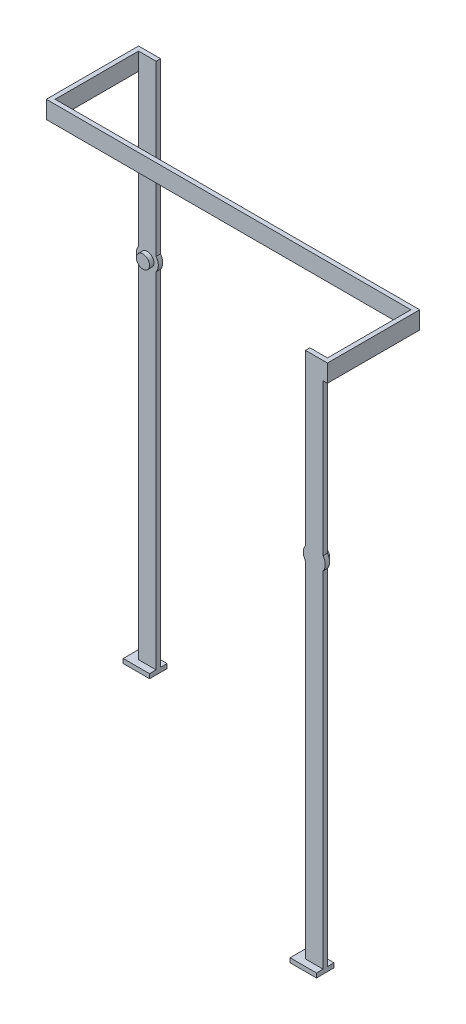
ISO-10303-21;
HEADER;
FILE_DESCRIPTION(('STEP AP214'),'2;1');
FILE_NAME('part.step','',(''),(''),'','','');
FILE_SCHEMA(('AUTOMOTIVE_DESIGN { 1 0 10303 214 1 1 1 1 }'));
ENDSEC;
DATA;
#1=APPLICATION_CONTEXT('core data for automotive mechanical design processes');
#2=APPLICATION_PROTOCOL_DEFINITION('international standard','automotive_design',2000,#1);
#3=PRODUCT_CONTEXT('',#1,'mechanical');
#4=PRODUCT('Part','Part','',(#3));
#5=PRODUCT_RELATED_PRODUCT_CATEGORY('part','',(#4));
#6=PRODUCT_DEFINITION_FORMATION('','',#4);
#7=PRODUCT_DEFINITION_CONTEXT('part definition',#1,'design');
#8=PRODUCT_DEFINITION('design','',#6,#7);
#9=PRODUCT_DEFINITION_SHAPE('','',#8);
#10=(LENGTH_UNIT() NAMED_UNIT(*) SI_UNIT(.MILLI.,.METRE.));
#11=(NAMED_UNIT(*) PLANE_ANGLE_UNIT() SI_UNIT($,.RADIAN.));
#12=(NAMED_UNIT(*) SI_UNIT($,.STERADIAN.) SOLID_ANGLE_UNIT());
#13=UNCERTAINTY_MEASURE_WITH_UNIT(LENGTH_MEASURE(1.E-05),#10,'distance_accuracy_value','');
#14=(GEOMETRIC_REPRESENTATION_CONTEXT(3) GLOBAL_UNCERTAINTY_ASSIGNED_CONTEXT((#13)) GLOBAL_UNIT_ASSIGNED_CONTEXT((#10,
#11,#12)) REPRESENTATION_CONTEXT('',''));
#15=CARTESIAN_POINT('',(0.,0.,0.));
#16=DIRECTION('',(0.,0.,1.));
#17=DIRECTION('',(1.,0.,0.));
#18=AXIS2_PLACEMENT_3D('',#15,#16,#17);
#19=CARTESIAN_POINT('',(-21.3512251283049,81.1533572870617,-20.5));
#20=DIRECTION('',(-1.,0.,0.));
#21=DIRECTION('',(0.,0.,1.));
#22=AXIS2_PLACEMENT_3D('',#19,#20,#21);
#23=PLANE('',#22);
#24=DIRECTION('',(0.,-1.,0.));
#25=VECTOR('',#24,1.);
#26=CARTESIAN_POINT('',(-21.3512251283049,85.1533572870618,-0.5));
#27=LINE('',#26,#25);
#28=CARTESIAN_POINT('',(-21.3512251283049,85.1533572870618,-0.5));
#29=VERTEX_POINT('',#28);
#30=CARTESIAN_POINT('',(-21.3512251283049,81.1533572870617,-0.5));
#31=VERTEX_POINT('',#30);
#32=EDGE_CURVE('E590',#29,#31,#27,.T.);
#33=ORIENTED_EDGE('',*,*,#32,.T.);
#34=DIRECTION('',(0.,0.,1.));
#35=VECTOR('',#34,1.);
#36=CARTESIAN_POINT('',(-21.3512251283049,81.1533572870617,-20.5));
#37=LINE('',#36,#35);
#38=CARTESIAN_POINT('',(-21.3512251283049,81.1533572870617,-19.5));
#39=VERTEX_POINT('',#38);
#40=EDGE_CURVE('E239',#39,#31,#37,.T.);
#41=ORIENTED_EDGE('',*,*,#40,.F.);
#42=DIRECTION('',(0.,1.,0.));
#43=VECTOR('',#42,1.);
#44=CARTESIAN_POINT('',(-21.3512251283049,45.15335728706,-19.5));
#45=LINE('',#44,#43);
#46=CARTESIAN_POINT('',(-21.3512251283049,85.1533572870618,-19.5));
#47=VERTEX_POINT('',#46);
#48=EDGE_CURVE('E267',#39,#47,#45,.T.);
#49=ORIENTED_EDGE('',*,*,#48,.T.);
#50=DIRECTION('',(0.,0.,-1.));
#51=VECTOR('',#50,1.);
#52=CARTESIAN_POINT('',(-21.3512251283049,85.1533572870618,-20.5));
#53=LINE('',#52,#51);
#54=EDGE_CURVE('E244',#29,#47,#53,.T.);
#55=ORIENTED_EDGE('',*,*,#54,.F.);
#56=EDGE_LOOP('',(#33,#41,#49,#55));
#57=FACE_BOUND('',#56,.T.);
#58=ADVANCED_FACE('F31',(#57),#23,.F.);
#59=CARTESIAN_POINT('',(-21.3512251283049,85.1533572870618,-20.5));
#60=DIRECTION('',(1.,0.,0.));
#61=DIRECTION('',(0.,1.,0.));
#62=AXIS2_PLACEMENT_3D('',#59,#60,#61);
#63=PLANE('',#62);
#64=CARTESIAN_POINT('',(-21.3512251283049,81.1533572870617,-20.5));
#65=VERTEX_POINT('',#64);
#66=EDGE_CURVE('E254',#65,#39,#37,.T.);
#67=ORIENTED_EDGE('',*,*,#66,.F.);
#68=DIRECTION('',(0.,1.,0.));
#69=VECTOR('',#68,1.);
#70=CARTESIAN_POINT('',(-21.3512251283049,85.1533572870618,-20.5));
#71=LINE('',#70,#69);
#72=CARTESIAN_POINT('',(-21.3512251283049,46.65335728706,-20.5));
#73=VERTEX_POINT('',#72);
#74=EDGE_CURVE('E274',#73,#65,#71,.T.);
#75=ORIENTED_EDGE('',*,*,#74,.F.);
#76=DIRECTION('',(0.,0.,1.));
#77=VECTOR('',#76,1.);
#78=CARTESIAN_POINT('',(-21.3512251283049,46.65335728706,-20.5));
#79=LINE('',#78,#77);
#80=CARTESIAN_POINT('',(-21.3512251283049,46.65335728706,-19.5));
#81=VERTEX_POINT('',#80);
#82=EDGE_CURVE('E286',#73,#81,#79,.T.);
#83=ORIENTED_EDGE('',*,*,#82,.T.);
#84=DIRECTION('',(0.,1.,0.));
#85=VECTOR('',#84,1.);
#86=CARTESIAN_POINT('',(-21.3512251283049,85.1533572870618,-19.5));
#87=LINE('',#86,#85);
#88=EDGE_CURVE('E129',#81,#39,#87,.T.);
#89=ORIENTED_EDGE('',*,*,#88,.T.);
#90=EDGE_LOOP('',(#67,#75,#83,#89));
#91=FACE_BOUND('',#90,.T.);
#92=ADVANCED_FACE('F285',(#91),#63,.F.);
#93=CARTESIAN_POINT('',(-19.3512251283049,45.15335728706,-19.5));
#94=DIRECTION('',(0.,0.,-1.));
#95=DIRECTION('',(0.,1.,0.));
#96=AXIS2_PLACEMENT_3D('',#93,#94,#95);
#97=PLANE('',#96);
#98=DIRECTION('',(0.,1.,0.));
#99=VECTOR('',#98,1.);
#100=CARTESIAN_POINT('',(-21.3512251283049,43.6533572870599,-19.5));
#101=LINE('',#100,#99);
#102=CARTESIAN_POINT('',(-21.3512251283049,-34.8466427129383,-19.5));
#103=VERTEX_POINT('',#102);
#104=CARTESIAN_POINT('',(-21.3512251283049,43.6533572870599,-19.5));
#105=VERTEX_POINT('',#104);
#106=EDGE_CURVE('E123',#103,#105,#101,.T.);
#107=ORIENTED_EDGE('',*,*,#106,.F.);
#108=DIRECTION('',(-1.,0.,0.));
#109=VECTOR('',#108,1.);
#110=CARTESIAN_POINT('',(-17.3512251283049,-34.8466427129383,-19.5));
#111=LINE('',#110,#109);
#112=CARTESIAN_POINT('',(-17.3512251283048,-34.8466427129382,-19.5));
#113=VERTEX_POINT('',#112);
#114=EDGE_CURVE('E141',#113,#103,#111,.T.);
#115=ORIENTED_EDGE('',*,*,#114,.F.);
#116=DIRECTION('',(0.,-1.,0.));
#117=VECTOR('',#116,1.);
#118=CARTESIAN_POINT('',(-17.3512251283049,43.65335728706,-19.5));
#119=LINE('',#118,#117);
#120=CARTESIAN_POINT('',(-17.3512251283049,43.65335728706,-19.5));
#121=VERTEX_POINT('',#120);
#122=EDGE_CURVE('E136',#121,#113,#119,.T.);
#123=ORIENTED_EDGE('',*,*,#122,.F.);
#124=CARTESIAN_POINT('',(-19.3512251283049,45.15335728706,-19.5));
#125=DIRECTION('',(0.,0.,-1.));
#126=DIRECTION('',(0.,1.,0.));
#127=AXIS2_PLACEMENT_3D('',#124,#125,#126);
#128=CIRCLE('',#127,2.5);
#129=CARTESIAN_POINT('',(-17.3512251283049,46.6533572870599,-19.5));
#130=VERTEX_POINT('',#129);
#131=EDGE_CURVE('E80',#130,#121,#128,.T.);
#132=ORIENTED_EDGE('',*,*,#131,.F.);
#133=DIRECTION('',(0.,-1.,0.));
#134=VECTOR('',#133,1.);
#135=CARTESIAN_POINT('',(-17.3512251283049,85.1533572870618,-19.5));
#136=LINE('',#135,#134);
#137=CARTESIAN_POINT('',(-17.3512251283049,85.1533572870618,-19.5));
#138=VERTEX_POINT('',#137);
#139=EDGE_CURVE('E73',#138,#130,#136,.T.);
#140=ORIENTED_EDGE('',*,*,#139,.F.);
#141=DIRECTION('',(1.,0.,0.));
#142=VECTOR('',#141,1.);
#143=CARTESIAN_POINT('',(-17.3512251283049,85.1533572870618,-19.5));
#144=LINE('',#143,#142);
#145=EDGE_CURVE('E132',#47,#138,#144,.T.);
#146=ORIENTED_EDGE('',*,*,#145,.F.);
#147=ORIENTED_EDGE('',*,*,#48,.F.);
#148=ORIENTED_EDGE('',*,*,#88,.F.);
#149=CARTESIAN_POINT('',(-19.3512251283049,45.15335728706,-19.5));
#150=DIRECTION('',(0.,0.,-1.));
#151=DIRECTION('',(0.,1.,0.));
#152=AXIS2_PLACEMENT_3D('',#149,#150,#151);
#153=CIRCLE('',#152,2.5);
#154=EDGE_CURVE('E126',#105,#81,#153,.T.);
#155=ORIENTED_EDGE('',*,*,#154,.F.);
#156=EDGE_LOOP('',(#107,#115,#123,#132,#140,#146,#147,#148,#155));
#157=FACE_BOUND('',#156,.T.);
#158=CARTESIAN_POINT('',(-19.3512251283052,45.1533572870617,-19.5));
#159=DIRECTION('',(0.,0.,-1.));
#160=DIRECTION('',(0.,1.,0.));
#161=AXIS2_PLACEMENT_3D('',#158,#159,#160);
#162=CIRCLE('',#161,1.49999999999978);
#163=CARTESIAN_POINT('',(-19.3512251283052,46.6533572870615,-19.5));
#164=VERTEX_POINT('',#163);
#165=EDGE_CURVE('E11',#164,#164,#162,.F.);
#166=ORIENTED_EDGE('',*,*,#165,.F.);
#167=EDGE_LOOP('',(#166));
#168=FACE_BOUND('',#167,.T.);
#169=ADVANCED_FACE('F300',(#157,#168),#97,.F.);
#170=CARTESIAN_POINT('',(-21.3512251283049,43.6533572870599,-20.5));
#171=DIRECTION('',(1.,0.,0.));
#172=DIRECTION('',(0.,1.,0.));
#173=AXIS2_PLACEMENT_3D('',#170,#171,#172);
#174=PLANE('',#173);
#175=ORIENTED_EDGE('',*,*,#106,.T.);
#176=DIRECTION('',(0.,0.,1.));
#177=VECTOR('',#176,1.);
#178=CARTESIAN_POINT('',(-21.3512251283049,43.6533572870599,-20.5));
#179=LINE('',#178,#177);
#180=CARTESIAN_POINT('',(-21.3512251283049,43.6533572870599,-20.5));
#181=VERTEX_POINT('',#180);
#182=EDGE_CURVE('E42',#181,#105,#179,.T.);
#183=ORIENTED_EDGE('',*,*,#182,.F.);
#184=DIRECTION('',(0.,1.,0.));
#185=VECTOR('',#184,1.);
#186=CARTESIAN_POINT('',(-21.3512251283049,43.6533572870599,-20.5));
#187=LINE('',#186,#185);
#188=CARTESIAN_POINT('',(-21.3512251283049,-34.8466427129383,-20.5));
#189=VERTEX_POINT('',#188);
#190=EDGE_CURVE('E144',#189,#181,#187,.T.);
#191=ORIENTED_EDGE('',*,*,#190,.F.);
#192=DIRECTION('',(0.,0.,1.));
#193=VECTOR('',#192,1.);
#194=CARTESIAN_POINT('',(-21.3512251283049,-34.8466427129383,-20.5));
#195=LINE('',#194,#193);
#196=EDGE_CURVE('E51',#189,#103,#195,.T.);
#197=ORIENTED_EDGE('',*,*,#196,.T.);
#198=EDGE_LOOP('',(#175,#183,#191,#197));
#199=FACE_BOUND('',#198,.T.);
#200=ADVANCED_FACE('F33',(#199),#174,.F.);
#201=CARTESIAN_POINT('',(-19.3512251283049,45.15335728706,-20.5));
#202=DIRECTION('',(0.,0.,1.));
#203=DIRECTION('',(0.,-1.,0.));
#204=AXIS2_PLACEMENT_3D('',#201,#202,#203);
#205=CYLINDRICAL_SURFACE('',#204,2.5);
#206=ORIENTED_EDGE('',*,*,#154,.T.);
#207=ORIENTED_EDGE('',*,*,#82,.F.);
#208=CARTESIAN_POINT('',(-19.3512251283049,45.15335728706,-20.5));
#209=DIRECTION('',(0.,0.,-1.));
#210=DIRECTION('',(0.,1.,0.));
#211=AXIS2_PLACEMENT_3D('',#208,#209,#210);
#212=CIRCLE('',#211,2.5);
#213=EDGE_CURVE('E89',#181,#73,#212,.T.);
#214=ORIENTED_EDGE('',*,*,#213,.F.);
#215=ORIENTED_EDGE('',*,*,#182,.T.);
#216=EDGE_LOOP('',(#206,#207,#214,#215));
#217=FACE_BOUND('',#216,.T.);
#218=ADVANCED_FACE('F535',(#217),#205,.T.);
#219=CARTESIAN_POINT('',(-17.3512251283049,85.1533572870618,-20.5));
#220=DIRECTION('',(0.,-1.,0.));
#221=DIRECTION('',(0.,0.,-1.));
#222=AXIS2_PLACEMENT_3D('',#219,#220,#221);
#223=PLANE('',#222);
#224=ORIENTED_EDGE('',*,*,#145,.T.);
#225=DIRECTION('',(0.,0.,1.));
#226=VECTOR('',#225,1.);
#227=CARTESIAN_POINT('',(-17.3512251283049,85.1533572870618,-20.5));
#228=LINE('',#227,#226);
#229=CARTESIAN_POINT('',(-17.3512251283049,85.1533572870618,-20.5));
#230=VERTEX_POINT('',#229);
#231=EDGE_CURVE('E112',#230,#138,#228,.T.);
#232=ORIENTED_EDGE('',*,*,#231,.F.);
#233=DIRECTION('',(1.,0.,0.));
#234=VECTOR('',#233,1.);
#235=CARTESIAN_POINT('',(-17.3512251283049,85.1533572870618,-20.5));
#236=LINE('',#235,#234);
#237=CARTESIAN_POINT('',(-22.3512251283049,85.1533572870618,-20.5));
#238=VERTEX_POINT('',#237);
#239=EDGE_CURVE('E107',#238,#230,#236,.T.);
#240=ORIENTED_EDGE('',*,*,#239,.F.);
#241=DIRECTION('',(0.,0.,-1.));
#242=VECTOR('',#241,1.);
#243=CARTESIAN_POINT('',(-22.3512251283049,85.1533572870618,-20.5));
#244=LINE('',#243,#242);
#245=CARTESIAN_POINT('',(-22.3512251283049,85.1533572870618,0.5));
#246=VERTEX_POINT('',#245);
#247=EDGE_CURVE('E250',#246,#238,#244,.T.);
#248=ORIENTED_EDGE('',*,*,#247,.F.);
#249=DIRECTION('',(1.,0.,0.));
#250=VECTOR('',#249,1.);
#251=CARTESIAN_POINT('',(-22.3512251283049,85.1533572870618,0.5));
#252=LINE('',#251,#250);
#253=CARTESIAN_POINT('',(60.6487748716913,85.1533572870618,0.5));
#254=VERTEX_POINT('',#253);
#255=EDGE_CURVE('E253',#246,#254,#252,.T.);
#256=ORIENTED_EDGE('',*,*,#255,.T.);
#257=DIRECTION('',(0.,0.,1.));
#258=VECTOR('',#257,1.);
#259=CARTESIAN_POINT('',(60.6487748716913,85.1533572870602,20.5));
#260=LINE('',#259,#258);
#261=CARTESIAN_POINT('',(60.6487748716913,85.1533572870602,19.5));
#262=VERTEX_POINT('',#261);
#263=EDGE_CURVE('E602',#254,#262,#260,.T.);
#264=ORIENTED_EDGE('',*,*,#263,.T.);
#265=DIRECTION('',(-1.,0.,0.));
#266=VECTOR('',#265,1.);
#267=CARTESIAN_POINT('',(56.6487748716913,85.1533572870602,19.5));
#268=LINE('',#267,#266);
#269=CARTESIAN_POINT('',(56.6487748716913,85.1533572870602,19.5));
#270=VERTEX_POINT('',#269);
#271=EDGE_CURVE('E210',#262,#270,#268,.T.);
#272=ORIENTED_EDGE('',*,*,#271,.T.);
#273=DIRECTION('',(0.,0.,-1.));
#274=VECTOR('',#273,1.);
#275=CARTESIAN_POINT('',(56.6487748716913,85.1533572870602,20.5));
#276=LINE('',#275,#274);
#277=CARTESIAN_POINT('',(56.6487748716913,85.1533572870602,20.5));
#278=VERTEX_POINT('',#277);
#279=EDGE_CURVE('E228',#278,#270,#276,.T.);
#280=ORIENTED_EDGE('',*,*,#279,.F.);
#281=DIRECTION('',(-1.,0.,0.));
#282=VECTOR('',#281,1.);
#283=CARTESIAN_POINT('',(56.6487748716913,85.1533572870602,20.5));
#284=LINE('',#283,#282);
#285=CARTESIAN_POINT('',(61.6487748716913,85.1533572870602,20.5));
#286=VERTEX_POINT('',#285);
#287=EDGE_CURVE('E194',#286,#278,#284,.T.);
#288=ORIENTED_EDGE('',*,*,#287,.F.);
#289=DIRECTION('',(0.,0.,1.));
#290=VECTOR('',#289,1.);
#291=CARTESIAN_POINT('',(61.6487748716913,85.1533572870602,20.5));
#292=LINE('',#291,#290);
#293=CARTESIAN_POINT('',(61.6487748716913,85.1533572870602,-0.5));
#294=VERTEX_POINT('',#293);
#295=EDGE_CURVE('E606',#294,#286,#292,.T.);
#296=ORIENTED_EDGE('',*,*,#295,.F.);
#297=DIRECTION('',(-1.,0.,0.));
#298=VECTOR('',#297,1.);
#299=CARTESIAN_POINT('',(61.6487748716913,85.1533572870602,-0.5));
#300=LINE('',#299,#298);
#301=EDGE_CURVE('E609',#294,#29,#300,.T.);
#302=ORIENTED_EDGE('',*,*,#301,.T.);
#303=ORIENTED_EDGE('',*,*,#54,.T.);
#304=EDGE_LOOP('',(#224,#232,#240,#248,#256,#264,#272,#280,#288,#296,#302,#303));
#305=FACE_BOUND('',#304,.T.);
#306=ADVANCED_FACE('F533',(#305),#223,.F.);
#307=CARTESIAN_POINT('',(-17.3512251283049,85.1533572870618,-20.5));
#308=DIRECTION('',(-1.,0.,0.));
#309=DIRECTION('',(0.,-1.,0.));
#310=AXIS2_PLACEMENT_3D('',#307,#308,#309);
#311=PLANE('',#310);
#312=ORIENTED_EDGE('',*,*,#139,.T.);
#313=DIRECTION('',(0.,0.,1.));
#314=VECTOR('',#313,1.);
#315=CARTESIAN_POINT('',(-17.3512251283049,46.6533572870599,-20.5));
#316=LINE('',#315,#314);
#317=CARTESIAN_POINT('',(-17.3512251283049,46.6533572870599,-20.5));
#318=VERTEX_POINT('',#317);
#319=EDGE_CURVE('E110',#318,#130,#316,.T.);
#320=ORIENTED_EDGE('',*,*,#319,.F.);
#321=DIRECTION('',(0.,-1.,0.));
#322=VECTOR('',#321,1.);
#323=CARTESIAN_POINT('',(-17.3512251283049,85.1533572870618,-20.5));
#324=LINE('',#323,#322);
#325=EDGE_CURVE('E100',#230,#318,#324,.T.);
#326=ORIENTED_EDGE('',*,*,#325,.F.);
#327=ORIENTED_EDGE('',*,*,#231,.T.);
#328=EDGE_LOOP('',(#312,#320,#326,#327));
#329=FACE_BOUND('',#328,.T.);
#330=ADVANCED_FACE('F111',(#329),#311,.F.);
#331=CARTESIAN_POINT('',(-19.3512251283049,45.15335728706,-20.5));
#332=DIRECTION('',(0.,0.,1.));
#333=DIRECTION('',(0.,-1.,0.));
#334=AXIS2_PLACEMENT_3D('',#331,#332,#333);
#335=CYLINDRICAL_SURFACE('',#334,2.5);
#336=ORIENTED_EDGE('',*,*,#131,.T.);
#337=DIRECTION('',(0.,0.,1.));
#338=VECTOR('',#337,1.);
#339=CARTESIAN_POINT('',(-17.3512251283049,43.65335728706,-20.5));
#340=LINE('',#339,#338);
#341=CARTESIAN_POINT('',(-17.3512251283049,43.65335728706,-20.5));
#342=VERTEX_POINT('',#341);
#343=EDGE_CURVE('E113',#342,#121,#340,.T.);
#344=ORIENTED_EDGE('',*,*,#343,.F.);
#345=CARTESIAN_POINT('',(-19.3512251283049,45.15335728706,-20.5));
#346=DIRECTION('',(0.,0.,-1.));
#347=DIRECTION('',(0.,1.,0.));
#348=AXIS2_PLACEMENT_3D('',#345,#346,#347);
#349=CIRCLE('',#348,2.5);
#350=EDGE_CURVE('E104',#318,#342,#349,.T.);
#351=ORIENTED_EDGE('',*,*,#350,.F.);
#352=ORIENTED_EDGE('',*,*,#319,.T.);
#353=EDGE_LOOP('',(#336,#344,#351,#352));
#354=FACE_BOUND('',#353,.T.);
#355=ADVANCED_FACE('F115',(#354),#335,.T.);
#356=CARTESIAN_POINT('',(-17.3512251283049,43.65335728706,-20.5));
#357=DIRECTION('',(-1.,0.,0.));
#358=DIRECTION('',(0.,-1.,0.));
#359=AXIS2_PLACEMENT_3D('',#356,#357,#358);
#360=PLANE('',#359);
#361=ORIENTED_EDGE('',*,*,#122,.T.);
#362=DIRECTION('',(0.,0.,1.));
#363=VECTOR('',#362,1.);
#364=CARTESIAN_POINT('',(-17.3512251283048,-34.8466427129382,-22.));
#365=LINE('',#364,#363);
#366=CARTESIAN_POINT('',(-17.3512251283048,-34.8466427129382,-18.));
#367=VERTEX_POINT('',#366);
#368=EDGE_CURVE('E452',#113,#367,#365,.T.);
#369=ORIENTED_EDGE('',*,*,#368,.T.);
#370=DIRECTION('',(0.,1.,0.));
#371=VECTOR('',#370,1.);
#372=CARTESIAN_POINT('',(-17.3512251283048,-35.8466427129382,-18.));
#373=LINE('',#372,#371);
#374=CARTESIAN_POINT('',(-17.3512251283048,-35.8466427129382,-18.));
#375=VERTEX_POINT('',#374);
#376=EDGE_CURVE('E567',#375,#367,#373,.T.);
#377=ORIENTED_EDGE('',*,*,#376,.F.);
#378=DIRECTION('',(0.,0.,1.));
#379=VECTOR('',#378,1.);
#380=CARTESIAN_POINT('',(-17.3512251283048,-35.8466427129382,-22.));
#381=LINE('',#380,#379);
#382=CARTESIAN_POINT('',(-17.3512251283048,-35.8466427129382,-22.));
#383=VERTEX_POINT('',#382);
#384=EDGE_CURVE('E579',#383,#375,#381,.T.);
#385=ORIENTED_EDGE('',*,*,#384,.F.);
#386=DIRECTION('',(0.,1.,0.));
#387=VECTOR('',#386,1.);
#388=CARTESIAN_POINT('',(-17.3512251283048,-35.8466427129382,-22.));
#389=LINE('',#388,#387);
#390=CARTESIAN_POINT('',(-17.3512251283048,-34.8466427129382,-22.));
#391=VERTEX_POINT('',#390);
#392=EDGE_CURVE('E559',#383,#391,#389,.T.);
#393=ORIENTED_EDGE('',*,*,#392,.T.);
#394=CARTESIAN_POINT('',(-17.3512251283048,-34.8466427129382,-20.5));
#395=VERTEX_POINT('',#394);
#396=EDGE_CURVE('E454',#391,#395,#365,.T.);
#397=ORIENTED_EDGE('',*,*,#396,.T.);
#398=DIRECTION('',(0.,-1.,0.));
#399=VECTOR('',#398,1.);
#400=CARTESIAN_POINT('',(-17.3512251283049,43.65335728706,-20.5));
#401=LINE('',#400,#399);
#402=EDGE_CURVE('E117',#342,#395,#401,.T.);
#403=ORIENTED_EDGE('',*,*,#402,.F.);
#404=ORIENTED_EDGE('',*,*,#343,.T.);
#405=EDGE_LOOP('',(#361,#369,#377,#385,#393,#397,#403,#404));
#406=FACE_BOUND('',#405,.T.);
#407=ADVANCED_FACE('F523',(#406),#360,.F.);
#408=CARTESIAN_POINT('',(-19.3512251283049,45.15335728706,-20.5));
#409=DIRECTION('',(0.,0.,-1.));
#410=DIRECTION('',(0.,1.,0.));
#411=AXIS2_PLACEMENT_3D('',#408,#409,#410);
#412=PLANE('',#411);
#413=ORIENTED_EDGE('',*,*,#190,.T.);
#414=ORIENTED_EDGE('',*,*,#213,.T.);
#415=ORIENTED_EDGE('',*,*,#74,.T.);
#416=DIRECTION('',(1.,0.,0.));
#417=VECTOR('',#416,1.);
#418=CARTESIAN_POINT('',(-22.3512251283049,81.1533572870617,-20.5));
#419=LINE('',#418,#417);
#420=CARTESIAN_POINT('',(-22.3512251283049,81.1533572870617,-20.5));
#421=VERTEX_POINT('',#420);
#422=EDGE_CURVE('E264',#421,#65,#419,.T.);
#423=ORIENTED_EDGE('',*,*,#422,.F.);
#424=DIRECTION('',(0.,-1.,0.));
#425=VECTOR('',#424,1.);
#426=CARTESIAN_POINT('',(-22.3512251283049,85.1533572870618,-20.5));
#427=LINE('',#426,#425);
#428=EDGE_CURVE('E240',#238,#421,#427,.T.);
#429=ORIENTED_EDGE('',*,*,#428,.F.);
#430=ORIENTED_EDGE('',*,*,#239,.T.);
#431=ORIENTED_EDGE('',*,*,#325,.T.);
#432=ORIENTED_EDGE('',*,*,#350,.T.);
#433=ORIENTED_EDGE('',*,*,#402,.T.);
#434=DIRECTION('',(-1.,0.,0.));
#435=VECTOR('',#434,1.);
#436=CARTESIAN_POINT('',(-17.3512251283049,-34.8466427129383,-20.5));
#437=LINE('',#436,#435);
#438=EDGE_CURVE('E119',#395,#189,#437,.T.);
#439=ORIENTED_EDGE('',*,*,#438,.T.);
#440=EDGE_LOOP('',(#413,#414,#415,#423,#429,#430,#431,#432,#433,#439));
#441=FACE_BOUND('',#440,.T.);
#442=ADVANCED_FACE('F101',(#441),#412,.T.);
#443=CARTESIAN_POINT('',(-19.3512251283052,45.1533572870617,-18.5));
#444=DIRECTION('',(0.,0.,-1.));
#445=DIRECTION('',(-1.,0.,0.));
#446=AXIS2_PLACEMENT_3D('',#443,#444,#445);
#447=CYLINDRICAL_SURFACE('',#446,1.49999999999978);
#448=CARTESIAN_POINT('',(-19.3512251283052,45.1533572870617,-18.5));
#449=DIRECTION('',(0.,0.,1.));
#450=DIRECTION('',(1.,0.,0.));
#451=AXIS2_PLACEMENT_3D('',#448,#449,#450);
#452=CIRCLE('',#451,1.49999999999978);
#453=CARTESIAN_POINT('',(-17.8512251283054,45.1533572870617,-18.5));
#454=VERTEX_POINT('',#453);
#455=EDGE_CURVE('E127',#454,#454,#452,.T.);
#456=ORIENTED_EDGE('',*,*,#455,.F.);
#457=EDGE_LOOP('',(#456));
#458=FACE_BOUND('',#457,.T.);
#459=ORIENTED_EDGE('',*,*,#165,.T.);
#460=EDGE_LOOP('',(#459));
#461=FACE_BOUND('',#460,.T.);
#462=ADVANCED_FACE('F516',(#458,#461),#447,.T.);
#463=CARTESIAN_POINT('',(-19.3512251283052,45.1533572870617,-18.5));
#464=DIRECTION('',(0.,0.,1.));
#465=DIRECTION('',(1.,0.,0.));
#466=AXIS2_PLACEMENT_3D('',#463,#464,#465);
#467=PLANE('',#466);
#468=ORIENTED_EDGE('',*,*,#455,.T.);
#469=EDGE_LOOP('',(#468));
#470=FACE_BOUND('',#469,.T.);
#471=ADVANCED_FACE('F513',(#470),#467,.T.);
#472=CARTESIAN_POINT('',(-22.3512251283049,81.1533572870617,-20.5));
#473=DIRECTION('',(0.,1.,0.));
#474=DIRECTION('',(0.,0.,1.));
#475=AXIS2_PLACEMENT_3D('',#472,#473,#474);
#476=PLANE('',#475);
#477=ORIENTED_EDGE('',*,*,#66,.T.);
#478=ORIENTED_EDGE('',*,*,#40,.T.);
#479=DIRECTION('',(-1.,0.,0.));
#480=VECTOR('',#479,1.);
#481=CARTESIAN_POINT('',(61.6487748716913,81.1533572870617,-0.5));
#482=LINE('',#481,#480);
#483=CARTESIAN_POINT('',(61.6487748716913,81.1533572870617,-0.5));
#484=VERTEX_POINT('',#483);
#485=EDGE_CURVE('E615',#484,#31,#482,.T.);
#486=ORIENTED_EDGE('',*,*,#485,.F.);
#487=DIRECTION('',(0.,0.,-1.));
#488=VECTOR('',#487,1.);
#489=CARTESIAN_POINT('',(61.6487748716913,81.1533572870617,20.5));
#490=LINE('',#489,#488);
#491=CARTESIAN_POINT('',(61.6487748716913,81.1533572870617,20.5));
#492=VERTEX_POINT('',#491);
#493=EDGE_CURVE('E601',#492,#484,#490,.T.);
#494=ORIENTED_EDGE('',*,*,#493,.F.);
#495=DIRECTION('',(-1.,0.,0.));
#496=VECTOR('',#495,1.);
#497=CARTESIAN_POINT('',(61.6487748716913,81.1533572870617,20.5));
#498=LINE('',#497,#496);
#499=CARTESIAN_POINT('',(60.6487748716913,81.1533572870617,20.5));
#500=VERTEX_POINT('',#499);
#501=EDGE_CURVE('E185',#492,#500,#498,.T.);
#502=ORIENTED_EDGE('',*,*,#501,.T.);
#503=DIRECTION('',(0.,0.,-1.));
#504=VECTOR('',#503,1.);
#505=CARTESIAN_POINT('',(60.6487748716913,81.1533572870617,20.5));
#506=LINE('',#505,#504);
#507=CARTESIAN_POINT('',(60.6487748716913,81.1533572870617,19.5));
#508=VERTEX_POINT('',#507);
#509=EDGE_CURVE('E610',#500,#508,#506,.T.);
#510=ORIENTED_EDGE('',*,*,#509,.T.);
#511=CARTESIAN_POINT('',(60.6487748716913,81.1533572870617,0.5));
#512=VERTEX_POINT('',#511);
#513=EDGE_CURVE('E596',#508,#512,#506,.T.);
#514=ORIENTED_EDGE('',*,*,#513,.T.);
#515=DIRECTION('',(1.,0.,0.));
#516=VECTOR('',#515,1.);
#517=CARTESIAN_POINT('',(-22.3512251283049,81.1533572870617,0.5));
#518=LINE('',#517,#516);
#519=CARTESIAN_POINT('',(-22.3512251283049,81.1533572870617,0.5));
#520=VERTEX_POINT('',#519);
#521=EDGE_CURVE('E261',#520,#512,#518,.T.);
#522=ORIENTED_EDGE('',*,*,#521,.F.);
#523=DIRECTION('',(0.,0.,1.));
#524=VECTOR('',#523,1.);
#525=CARTESIAN_POINT('',(-22.3512251283049,81.1533572870617,-20.5));
#526=LINE('',#525,#524);
#527=EDGE_CURVE('E243',#421,#520,#526,.T.);
#528=ORIENTED_EDGE('',*,*,#527,.F.);
#529=ORIENTED_EDGE('',*,*,#422,.T.);
#530=EDGE_LOOP('',(#477,#478,#486,#494,#502,#510,#514,#522,#528,#529));
#531=FACE_BOUND('',#530,.T.);
#532=ADVANCED_FACE('F291',(#531),#476,.F.);
#533=CARTESIAN_POINT('',(-22.3512251283049,85.1533572870618,0.5));
#534=DIRECTION('',(0.,0.,-1.));
#535=DIRECTION('',(0.,1.,0.));
#536=AXIS2_PLACEMENT_3D('',#533,#534,#535);
#537=PLANE('',#536);
#538=ORIENTED_EDGE('',*,*,#521,.T.);
#539=DIRECTION('',(0.,1.,0.));
#540=VECTOR('',#539,1.);
#541=CARTESIAN_POINT('',(60.6487748716913,85.1533572870618,0.5));
#542=LINE('',#541,#540);
#543=EDGE_CURVE('E592',#512,#254,#542,.T.);
#544=ORIENTED_EDGE('',*,*,#543,.T.);
#545=ORIENTED_EDGE('',*,*,#255,.F.);
#546=DIRECTION('',(0.,1.,0.));
#547=VECTOR('',#546,1.);
#548=CARTESIAN_POINT('',(-22.3512251283049,85.1533572870618,0.5));
#549=LINE('',#548,#547);
#550=EDGE_CURVE('E247',#520,#246,#549,.T.);
#551=ORIENTED_EDGE('',*,*,#550,.F.);
#552=EDGE_LOOP('',(#538,#544,#545,#551));
#553=FACE_BOUND('',#552,.T.);
#554=ADVANCED_FACE('F507',(#553),#537,.F.);
#555=CARTESIAN_POINT('',(-22.3512251283049,81.1533572870617,-20.5));
#556=DIRECTION('',(-1.,0.,0.));
#557=DIRECTION('',(0.,0.,1.));
#558=AXIS2_PLACEMENT_3D('',#555,#556,#557);
#559=PLANE('',#558);
#560=ORIENTED_EDGE('',*,*,#428,.T.);
#561=ORIENTED_EDGE('',*,*,#527,.T.);
#562=ORIENTED_EDGE('',*,*,#550,.T.);
#563=ORIENTED_EDGE('',*,*,#247,.T.);
#564=EDGE_LOOP('',(#560,#561,#562,#563));
#565=FACE_BOUND('',#564,.T.);
#566=ADVANCED_FACE('F506',(#565),#559,.T.);
#567=CARTESIAN_POINT('',(60.6487748716913,85.1533572870602,20.5));
#568=DIRECTION('',(-1.,0.,0.));
#569=DIRECTION('',(0.,-1.,0.));
#570=AXIS2_PLACEMENT_3D('',#567,#568,#569);
#571=PLANE('',#570);
#572=ORIENTED_EDGE('',*,*,#509,.F.);
#573=DIRECTION('',(0.,1.,0.));
#574=VECTOR('',#573,1.);
#575=CARTESIAN_POINT('',(60.6487748716913,85.1533572870602,20.5));
#576=LINE('',#575,#574);
#577=CARTESIAN_POINT('',(60.6487748716913,46.6533572870603,20.5));
#578=VERTEX_POINT('',#577);
#579=EDGE_CURVE('E191',#578,#500,#576,.T.);
#580=ORIENTED_EDGE('',*,*,#579,.F.);
#581=DIRECTION('',(0.,0.,-1.));
#582=VECTOR('',#581,1.);
#583=CARTESIAN_POINT('',(60.6487748716913,46.6533572870603,20.5));
#584=LINE('',#583,#582);
#585=CARTESIAN_POINT('',(60.6487748716913,46.6533572870603,19.5));
#586=VERTEX_POINT('',#585);
#587=EDGE_CURVE('E231',#578,#586,#584,.T.);
#588=ORIENTED_EDGE('',*,*,#587,.T.);
#589=DIRECTION('',(0.,1.,0.));
#590=VECTOR('',#589,1.);
#591=CARTESIAN_POINT('',(60.6487748716913,85.1533572870602,19.5));
#592=LINE('',#591,#590);
#593=EDGE_CURVE('E170',#586,#508,#592,.T.);
#594=ORIENTED_EDGE('',*,*,#593,.T.);
#595=EDGE_LOOP('',(#572,#580,#588,#594));
#596=FACE_BOUND('',#595,.T.);
#597=ADVANCED_FACE('F495',(#596),#571,.F.);
#598=CARTESIAN_POINT('',(58.6487748716914,45.1533572870601,19.5));
#599=DIRECTION('',(0.,0.,1.));
#600=DIRECTION('',(1.,0.,0.));
#601=AXIS2_PLACEMENT_3D('',#598,#599,#600);
#602=PLANE('',#601);
#603=DIRECTION('',(1.,0.,0.));
#604=VECTOR('',#603,1.);
#605=CARTESIAN_POINT('',(56.6487748716913,-34.8466427129398,19.5));
#606=LINE('',#605,#604);
#607=CARTESIAN_POINT('',(56.6487748716913,-34.8466427129398,19.5));
#608=VERTEX_POINT('',#607);
#609=CARTESIAN_POINT('',(60.6487748716913,-34.8466427129398,19.5));
#610=VERTEX_POINT('',#609);
#611=EDGE_CURVE('E35',#608,#610,#606,.T.);
#612=ORIENTED_EDGE('',*,*,#611,.F.);
#613=DIRECTION('',(0.,-1.,0.));
#614=VECTOR('',#613,1.);
#615=CARTESIAN_POINT('',(56.6487748716913,43.6533572870603,19.5));
#616=LINE('',#615,#614);
#617=CARTESIAN_POINT('',(56.6487748716913,43.6533572870603,19.5));
#618=VERTEX_POINT('',#617);
#619=EDGE_CURVE('E156',#618,#608,#616,.T.);
#620=ORIENTED_EDGE('',*,*,#619,.F.);
#621=CARTESIAN_POINT('',(58.6487748716914,45.1533572870601,19.5));
#622=DIRECTION('',(0.,0.,1.));
#623=DIRECTION('',(1.,0.,0.));
#624=AXIS2_PLACEMENT_3D('',#621,#622,#623);
#625=CIRCLE('',#624,2.5);
#626=CARTESIAN_POINT('',(56.6487748716913,46.6533572870599,19.5));
#627=VERTEX_POINT('',#626);
#628=EDGE_CURVE('E216',#627,#618,#625,.T.);
#629=ORIENTED_EDGE('',*,*,#628,.F.);
#630=DIRECTION('',(0.,-1.,0.));
#631=VECTOR('',#630,1.);
#632=CARTESIAN_POINT('',(56.6487748716913,85.1533572870602,19.5));
#633=LINE('',#632,#631);
#634=EDGE_CURVE('E213',#270,#627,#633,.T.);
#635=ORIENTED_EDGE('',*,*,#634,.F.);
#636=ORIENTED_EDGE('',*,*,#271,.F.);
#637=DIRECTION('',(0.,1.,0.));
#638=VECTOR('',#637,1.);
#639=CARTESIAN_POINT('',(60.6487748716913,45.1533572870601,19.5));
#640=LINE('',#639,#638);
#641=EDGE_CURVE('E180',#508,#262,#640,.T.);
#642=ORIENTED_EDGE('',*,*,#641,.F.);
#643=ORIENTED_EDGE('',*,*,#593,.F.);
#644=CARTESIAN_POINT('',(58.6487748716914,45.1533572870601,19.5));
#645=DIRECTION('',(0.,0.,1.));
#646=DIRECTION('',(1.,0.,0.));
#647=AXIS2_PLACEMENT_3D('',#644,#645,#646);
#648=CIRCLE('',#647,2.5);
#649=CARTESIAN_POINT('',(60.6487748716913,43.6533572870599,19.5));
#650=VERTEX_POINT('',#649);
#651=EDGE_CURVE('E161',#650,#586,#648,.T.);
#652=ORIENTED_EDGE('',*,*,#651,.F.);
#653=DIRECTION('',(0.,1.,0.));
#654=VECTOR('',#653,1.);
#655=CARTESIAN_POINT('',(60.6487748716913,43.6533572870599,19.5));
#656=LINE('',#655,#654);
#657=EDGE_CURVE('E159',#610,#650,#656,.T.);
#658=ORIENTED_EDGE('',*,*,#657,.F.);
#659=EDGE_LOOP('',(#612,#620,#629,#635,#636,#642,#643,#652,#658));
#660=FACE_BOUND('',#659,.T.);
#661=CARTESIAN_POINT('',(58.6487748716914,45.1533572870601,19.5));
#662=DIRECTION('',(0.,0.,1.));
#663=DIRECTION('',(1.,0.,0.));
#664=AXIS2_PLACEMENT_3D('',#661,#662,#663);
#665=CIRCLE('',#664,1.5);
#666=CARTESIAN_POINT('',(60.1487748716914,45.1533572870601,19.5));
#667=VERTEX_POINT('',#666);
#668=EDGE_CURVE('E236',#667,#667,#665,.F.);
#669=ORIENTED_EDGE('',*,*,#668,.F.);
#670=EDGE_LOOP('',(#669));
#671=FACE_BOUND('',#670,.T.);
#672=ADVANCED_FACE('F486',(#660,#671),#602,.F.);
#673=CARTESIAN_POINT('',(60.6487748716913,43.6533572870599,20.5));
#674=DIRECTION('',(-1.,0.,0.));
#675=DIRECTION('',(0.,-1.,0.));
#676=AXIS2_PLACEMENT_3D('',#673,#674,#675);
#677=PLANE('',#676);
#678=ORIENTED_EDGE('',*,*,#657,.T.);
#679=DIRECTION('',(0.,0.,-1.));
#680=VECTOR('',#679,1.);
#681=CARTESIAN_POINT('',(60.6487748716913,43.6533572870599,20.5));
#682=LINE('',#681,#680);
#683=CARTESIAN_POINT('',(60.6487748716913,43.6533572870599,20.5));
#684=VERTEX_POINT('',#683);
#685=EDGE_CURVE('E234',#684,#650,#682,.T.);
#686=ORIENTED_EDGE('',*,*,#685,.F.);
#687=DIRECTION('',(0.,1.,0.));
#688=VECTOR('',#687,1.);
#689=CARTESIAN_POINT('',(60.6487748716913,43.6533572870599,20.5));
#690=LINE('',#689,#688);
#691=CARTESIAN_POINT('',(60.6487748716913,-34.8466427129398,20.5));
#692=VERTEX_POINT('',#691);
#693=EDGE_CURVE('E147',#692,#684,#690,.T.);
#694=ORIENTED_EDGE('',*,*,#693,.F.);
#695=DIRECTION('',(0.,0.,1.));
#696=VECTOR('',#695,1.);
#697=CARTESIAN_POINT('',(60.6487748716913,-34.8466427129398,22.));
#698=LINE('',#697,#696);
#699=CARTESIAN_POINT('',(60.6487748716913,-34.8466427129398,22.));
#700=VERTEX_POINT('',#699);
#701=EDGE_CURVE('E463',#692,#700,#698,.T.);
#702=ORIENTED_EDGE('',*,*,#701,.T.);
#703=DIRECTION('',(0.,1.,0.));
#704=VECTOR('',#703,1.);
#705=CARTESIAN_POINT('',(60.6487748716913,-35.8466427129398,22.));
#706=LINE('',#705,#704);
#707=CARTESIAN_POINT('',(60.6487748716913,-35.8466427129398,22.));
#708=VERTEX_POINT('',#707);
#709=EDGE_CURVE('E456',#708,#700,#706,.T.);
#710=ORIENTED_EDGE('',*,*,#709,.F.);
#711=DIRECTION('',(0.,0.,1.));
#712=VECTOR('',#711,1.);
#713=CARTESIAN_POINT('',(60.6487748716913,-35.8466427129398,22.));
#714=LINE('',#713,#712);
#715=CARTESIAN_POINT('',(60.6487748716913,-35.8466427129398,18.));
#716=VERTEX_POINT('',#715);
#717=EDGE_CURVE('E437',#716,#708,#714,.T.);
#718=ORIENTED_EDGE('',*,*,#717,.F.);
#719=DIRECTION('',(0.,1.,0.));
#720=VECTOR('',#719,1.);
#721=CARTESIAN_POINT('',(60.6487748716913,-35.8466427129398,18.));
#722=LINE('',#721,#720);
#723=CARTESIAN_POINT('',(60.6487748716913,-34.8466427129398,18.));
#724=VERTEX_POINT('',#723);
#725=EDGE_CURVE('E434',#716,#724,#722,.T.);
#726=ORIENTED_EDGE('',*,*,#725,.T.);
#727=EDGE_CURVE('E460',#724,#610,#698,.T.);
#728=ORIENTED_EDGE('',*,*,#727,.T.);
#729=EDGE_LOOP('',(#678,#686,#694,#702,#710,#718,#726,#728));
#730=FACE_BOUND('',#729,.T.);
#731=ADVANCED_FACE('F483',(#730),#677,.F.);
#732=CARTESIAN_POINT('',(58.6487748716914,45.1533572870601,20.5));
#733=DIRECTION('',(0.,0.,-1.));
#734=DIRECTION('',(-1.,0.,0.));
#735=AXIS2_PLACEMENT_3D('',#732,#733,#734);
#736=CYLINDRICAL_SURFACE('',#735,2.5);
#737=ORIENTED_EDGE('',*,*,#651,.T.);
#738=ORIENTED_EDGE('',*,*,#587,.F.);
#739=CARTESIAN_POINT('',(58.6487748716914,45.1533572870601,20.5));
#740=DIRECTION('',(0.,0.,1.));
#741=DIRECTION('',(1.,0.,0.));
#742=AXIS2_PLACEMENT_3D('',#739,#740,#741);
#743=CIRCLE('',#742,2.5);
#744=EDGE_CURVE('E150',#684,#578,#743,.T.);
#745=ORIENTED_EDGE('',*,*,#744,.F.);
#746=ORIENTED_EDGE('',*,*,#685,.T.);
#747=EDGE_LOOP('',(#737,#738,#745,#746));
#748=FACE_BOUND('',#747,.T.);
#749=ADVANCED_FACE('F485',(#748),#736,.T.);
#750=CARTESIAN_POINT('',(56.6487748716913,85.1533572870602,20.5));
#751=DIRECTION('',(1.,0.,0.));
#752=DIRECTION('',(0.,1.,0.));
#753=AXIS2_PLACEMENT_3D('',#750,#751,#752);
#754=PLANE('',#753);
#755=ORIENTED_EDGE('',*,*,#634,.T.);
#756=DIRECTION('',(0.,0.,-1.));
#757=VECTOR('',#756,1.);
#758=CARTESIAN_POINT('',(56.6487748716913,46.6533572870599,20.5));
#759=LINE('',#758,#757);
#760=CARTESIAN_POINT('',(56.6487748716913,46.6533572870599,20.5));
#761=VERTEX_POINT('',#760);
#762=EDGE_CURVE('E225',#761,#627,#759,.T.);
#763=ORIENTED_EDGE('',*,*,#762,.F.);
#764=DIRECTION('',(0.,-1.,0.));
#765=VECTOR('',#764,1.);
#766=CARTESIAN_POINT('',(56.6487748716913,85.1533572870602,20.5));
#767=LINE('',#766,#765);
#768=EDGE_CURVE('E197',#278,#761,#767,.T.);
#769=ORIENTED_EDGE('',*,*,#768,.F.);
#770=ORIENTED_EDGE('',*,*,#279,.T.);
#771=EDGE_LOOP('',(#755,#763,#769,#770));
#772=FACE_BOUND('',#771,.T.);
#773=ADVANCED_FACE('F492',(#772),#754,.F.);
#774=CARTESIAN_POINT('',(58.6487748716914,45.1533572870601,20.5));
#775=DIRECTION('',(0.,0.,-1.));
#776=DIRECTION('',(-1.,0.,0.));
#777=AXIS2_PLACEMENT_3D('',#774,#775,#776);
#778=CYLINDRICAL_SURFACE('',#777,2.5);
#779=ORIENTED_EDGE('',*,*,#628,.T.);
#780=DIRECTION('',(0.,0.,-1.));
#781=VECTOR('',#780,1.);
#782=CARTESIAN_POINT('',(56.6487748716913,43.6533572870603,20.5));
#783=LINE('',#782,#781);
#784=CARTESIAN_POINT('',(56.6487748716913,43.6533572870603,20.5));
#785=VERTEX_POINT('',#784);
#786=EDGE_CURVE('E222',#785,#618,#783,.T.);
#787=ORIENTED_EDGE('',*,*,#786,.F.);
#788=CARTESIAN_POINT('',(58.6487748716914,45.1533572870601,20.5));
#789=DIRECTION('',(0.,0.,1.));
#790=DIRECTION('',(1.,0.,0.));
#791=AXIS2_PLACEMENT_3D('',#788,#789,#790);
#792=CIRCLE('',#791,2.5);
#793=EDGE_CURVE('E200',#761,#785,#792,.T.);
#794=ORIENTED_EDGE('',*,*,#793,.F.);
#795=ORIENTED_EDGE('',*,*,#762,.T.);
#796=EDGE_LOOP('',(#779,#787,#794,#795));
#797=FACE_BOUND('',#796,.T.);
#798=ADVANCED_FACE('F651',(#797),#778,.T.);
#799=CARTESIAN_POINT('',(56.6487748716913,43.6533572870603,20.5));
#800=DIRECTION('',(1.,0.,0.));
#801=DIRECTION('',(0.,1.,0.));
#802=AXIS2_PLACEMENT_3D('',#799,#800,#801);
#803=PLANE('',#802);
#804=ORIENTED_EDGE('',*,*,#619,.T.);
#805=DIRECTION('',(0.,0.,-1.));
#806=VECTOR('',#805,1.);
#807=CARTESIAN_POINT('',(56.6487748716913,-34.8466427129398,20.5));
#808=LINE('',#807,#806);
#809=CARTESIAN_POINT('',(56.6487748716913,-34.8466427129398,20.5));
#810=VERTEX_POINT('',#809);
#811=EDGE_CURVE('E205',#810,#608,#808,.T.);
#812=ORIENTED_EDGE('',*,*,#811,.F.);
#813=DIRECTION('',(0.,-1.,0.));
#814=VECTOR('',#813,1.);
#815=CARTESIAN_POINT('',(56.6487748716913,43.6533572870603,20.5));
#816=LINE('',#815,#814);
#817=EDGE_CURVE('E203',#785,#810,#816,.T.);
#818=ORIENTED_EDGE('',*,*,#817,.F.);
#819=ORIENTED_EDGE('',*,*,#786,.T.);
#820=EDGE_LOOP('',(#804,#812,#818,#819));
#821=FACE_BOUND('',#820,.T.);
#822=ADVANCED_FACE('F655',(#821),#803,.F.);
#823=CARTESIAN_POINT('',(58.6487748716914,45.1533572870601,20.5));
#824=DIRECTION('',(0.,0.,1.));
#825=DIRECTION('',(1.,0.,0.));
#826=AXIS2_PLACEMENT_3D('',#823,#824,#825);
#827=PLANE('',#826);
#828=DIRECTION('',(1.,0.,0.));
#829=VECTOR('',#828,1.);
#830=CARTESIAN_POINT('',(56.6487748716913,-34.8466427129398,20.5));
#831=LINE('',#830,#829);
#832=EDGE_CURVE('E151',#810,#692,#831,.T.);
#833=ORIENTED_EDGE('',*,*,#832,.T.);
#834=ORIENTED_EDGE('',*,*,#693,.T.);
#835=ORIENTED_EDGE('',*,*,#744,.T.);
#836=ORIENTED_EDGE('',*,*,#579,.T.);
#837=ORIENTED_EDGE('',*,*,#501,.F.);
#838=DIRECTION('',(0.,-1.,0.));
#839=VECTOR('',#838,1.);
#840=CARTESIAN_POINT('',(61.6487748716913,85.1533572870602,20.5));
#841=LINE('',#840,#839);
#842=EDGE_CURVE('E598',#286,#492,#841,.T.);
#843=ORIENTED_EDGE('',*,*,#842,.F.);
#844=ORIENTED_EDGE('',*,*,#287,.T.);
#845=ORIENTED_EDGE('',*,*,#768,.T.);
#846=ORIENTED_EDGE('',*,*,#793,.T.);
#847=ORIENTED_EDGE('',*,*,#817,.T.);
#848=EDGE_LOOP('',(#833,#834,#835,#836,#837,#843,#844,#845,#846,#847));
#849=FACE_BOUND('',#848,.T.);
#850=ADVANCED_FACE('F625',(#849),#827,.T.);
#851=CARTESIAN_POINT('',(58.6487748716914,45.1533572870601,18.5));
#852=DIRECTION('',(0.,0.,1.));
#853=DIRECTION('',(1.,0.,0.));
#854=AXIS2_PLACEMENT_3D('',#851,#852,#853);
#855=CYLINDRICAL_SURFACE('',#854,1.5);
#856=CARTESIAN_POINT('',(58.6487748716914,45.1533572870601,18.5));
#857=DIRECTION('',(0.,0.,-1.));
#858=DIRECTION('',(-1.,0.,0.));
#859=AXIS2_PLACEMENT_3D('',#856,#857,#858);
#860=CIRCLE('',#859,1.5);
#861=CARTESIAN_POINT('',(57.1487748716914,45.1533572870601,18.5));
#862=VERTEX_POINT('',#861);
#863=EDGE_CURVE('E173',#862,#862,#860,.T.);
#864=ORIENTED_EDGE('',*,*,#863,.F.);
#865=EDGE_LOOP('',(#864));
#866=FACE_BOUND('',#865,.T.);
#867=ORIENTED_EDGE('',*,*,#668,.T.);
#868=EDGE_LOOP('',(#867));
#869=FACE_BOUND('',#868,.T.);
#870=ADVANCED_FACE('F677',(#866,#869),#855,.T.);
#871=CARTESIAN_POINT('',(58.6487748716914,45.1533572870601,18.5));
#872=DIRECTION('',(0.,0.,-1.));
#873=DIRECTION('',(-1.,0.,0.));
#874=AXIS2_PLACEMENT_3D('',#871,#872,#873);
#875=PLANE('',#874);
#876=ORIENTED_EDGE('',*,*,#863,.T.);
#877=EDGE_LOOP('',(#876));
#878=FACE_BOUND('',#877,.T.);
#879=ADVANCED_FACE('F672',(#878),#875,.T.);
#880=CARTESIAN_POINT('',(60.6487748716913,81.1533572870617,20.5));
#881=DIRECTION('',(1.,0.,0.));
#882=DIRECTION('',(0.,0.,-1.));
#883=AXIS2_PLACEMENT_3D('',#880,#881,#882);
#884=PLANE('',#883);
#885=ORIENTED_EDGE('',*,*,#263,.F.);
#886=ORIENTED_EDGE('',*,*,#543,.F.);
#887=ORIENTED_EDGE('',*,*,#513,.F.);
#888=ORIENTED_EDGE('',*,*,#641,.T.);
#889=EDGE_LOOP('',(#885,#886,#887,#888));
#890=FACE_BOUND('',#889,.T.);
#891=ADVANCED_FACE('F634',(#890),#884,.F.);
#892=CARTESIAN_POINT('',(61.6487748716913,85.1533572870602,-0.5));
#893=DIRECTION('',(0.,0.,1.));
#894=DIRECTION('',(1.,0.,0.));
#895=AXIS2_PLACEMENT_3D('',#892,#893,#894);
#896=PLANE('',#895);
#897=ORIENTED_EDGE('',*,*,#485,.T.);
#898=ORIENTED_EDGE('',*,*,#32,.F.);
#899=ORIENTED_EDGE('',*,*,#301,.F.);
#900=DIRECTION('',(0.,1.,0.));
#901=VECTOR('',#900,1.);
#902=CARTESIAN_POINT('',(61.6487748716913,85.1533572870602,-0.5));
#903=LINE('',#902,#901);
#904=EDGE_CURVE('E604',#484,#294,#903,.T.);
#905=ORIENTED_EDGE('',*,*,#904,.F.);
#906=EDGE_LOOP('',(#897,#898,#899,#905));
#907=FACE_BOUND('',#906,.T.);
#908=ADVANCED_FACE('F663',(#907),#896,.F.);
#909=CARTESIAN_POINT('',(61.6487748716913,81.1533572870617,20.5));
#910=DIRECTION('',(1.,0.,0.));
#911=DIRECTION('',(0.,0.,-1.));
#912=AXIS2_PLACEMENT_3D('',#909,#910,#911);
#913=PLANE('',#912);
#914=ORIENTED_EDGE('',*,*,#842,.T.);
#915=ORIENTED_EDGE('',*,*,#493,.T.);
#916=ORIENTED_EDGE('',*,*,#904,.T.);
#917=ORIENTED_EDGE('',*,*,#295,.T.);
#918=EDGE_LOOP('',(#914,#915,#916,#917));
#919=FACE_BOUND('',#918,.T.);
#920=ADVANCED_FACE('F659',(#919),#913,.T.);
#921=CARTESIAN_POINT('',(-17.3512251283048,-34.8466427129382,-18.));
#922=DIRECTION('',(0.,-1.,0.));
#923=DIRECTION('',(1.,0.,0.));
#924=AXIS2_PLACEMENT_3D('',#921,#922,#923);
#925=PLANE('',#924);
#926=ORIENTED_EDGE('',*,*,#368,.F.);
#927=ORIENTED_EDGE('',*,*,#114,.T.);
#928=ORIENTED_EDGE('',*,*,#196,.F.);
#929=ORIENTED_EDGE('',*,*,#438,.F.);
#930=ORIENTED_EDGE('',*,*,#396,.F.);
#931=DIRECTION('',(1.,0.,0.));
#932=VECTOR('',#931,1.);
#933=CARTESIAN_POINT('',(-17.3512251283048,-34.8466427129382,-22.));
#934=LINE('',#933,#932);
#935=CARTESIAN_POINT('',(-23.3512251283048,-34.8466427129382,-22.));
#936=VERTEX_POINT('',#935);
#937=EDGE_CURVE('E577',#936,#391,#934,.T.);
#938=ORIENTED_EDGE('',*,*,#937,.F.);
#939=DIRECTION('',(0.,0.,-1.));
#940=VECTOR('',#939,1.);
#941=CARTESIAN_POINT('',(-23.3512251283048,-34.8466427129382,-22.));
#942=LINE('',#941,#940);
#943=CARTESIAN_POINT('',(-23.3512251283048,-34.8466427129382,-18.));
#944=VERTEX_POINT('',#943);
#945=EDGE_CURVE('E563',#944,#936,#942,.T.);
#946=ORIENTED_EDGE('',*,*,#945,.F.);
#947=DIRECTION('',(-1.,0.,0.));
#948=VECTOR('',#947,1.);
#949=CARTESIAN_POINT('',(-17.3512251283048,-34.8466427129382,-18.));
#950=LINE('',#949,#948);
#951=EDGE_CURVE('E561',#367,#944,#950,.T.);
#952=ORIENTED_EDGE('',*,*,#951,.F.);
#953=EDGE_LOOP('',(#926,#927,#928,#929,#930,#938,#946,#952));
#954=FACE_BOUND('',#953,.T.);
#955=ADVANCED_FACE('F670',(#954),#925,.F.);
#956=CARTESIAN_POINT('',(-17.3512251283048,-35.8466427129382,-18.));
#957=DIRECTION('',(0.,0.,-1.));
#958=DIRECTION('',(0.,1.,0.));
#959=AXIS2_PLACEMENT_3D('',#956,#957,#958);
#960=PLANE('',#959);
#961=ORIENTED_EDGE('',*,*,#951,.T.);
#962=DIRECTION('',(0.,1.,0.));
#963=VECTOR('',#962,1.);
#964=CARTESIAN_POINT('',(-23.3512251283048,-35.8466427129382,-18.));
#965=LINE('',#964,#963);
#966=CARTESIAN_POINT('',(-23.3512251283048,-35.8466427129382,-18.));
#967=VERTEX_POINT('',#966);
#968=EDGE_CURVE('E583',#967,#944,#965,.T.);
#969=ORIENTED_EDGE('',*,*,#968,.F.);
#970=DIRECTION('',(-1.,0.,0.));
#971=VECTOR('',#970,1.);
#972=CARTESIAN_POINT('',(-17.3512251283048,-35.8466427129382,-18.));
#973=LINE('',#972,#971);
#974=EDGE_CURVE('E970',#375,#967,#973,.T.);
#975=ORIENTED_EDGE('',*,*,#974,.F.);
#976=ORIENTED_EDGE('',*,*,#376,.T.);
#977=EDGE_LOOP('',(#961,#969,#975,#976));
#978=FACE_BOUND('',#977,.T.);
#979=ADVANCED_FACE('F790',(#978),#960,.F.);
#980=CARTESIAN_POINT('',(-23.3512251283048,-35.8466427129382,-22.));
#981=DIRECTION('',(1.,0.,0.));
#982=DIRECTION('',(0.,1.,0.));
#983=AXIS2_PLACEMENT_3D('',#980,#981,#982);
#984=PLANE('',#983);
#985=ORIENTED_EDGE('',*,*,#945,.T.);
#986=DIRECTION('',(0.,1.,0.));
#987=VECTOR('',#986,1.);
#988=CARTESIAN_POINT('',(-23.3512251283048,-35.8466427129382,-22.));
#989=LINE('',#988,#987);
#990=CARTESIAN_POINT('',(-23.3512251283048,-35.8466427129382,-22.));
#991=VERTEX_POINT('',#990);
#992=EDGE_CURVE('E581',#991,#936,#989,.T.);
#993=ORIENTED_EDGE('',*,*,#992,.F.);
#994=DIRECTION('',(0.,0.,-1.));
#995=VECTOR('',#994,1.);
#996=CARTESIAN_POINT('',(-23.3512251283048,-35.8466427129382,-22.));
#997=LINE('',#996,#995);
#998=EDGE_CURVE('E972',#967,#991,#997,.T.);
#999=ORIENTED_EDGE('',*,*,#998,.F.);
#1000=ORIENTED_EDGE('',*,*,#968,.T.);
#1001=EDGE_LOOP('',(#985,#993,#999,#1000));
#1002=FACE_BOUND('',#1001,.T.);
#1003=ADVANCED_FACE('F798',(#1002),#984,.F.);
#1004=CARTESIAN_POINT('',(-17.3512251283048,-35.8466427129382,-22.));
#1005=DIRECTION('',(0.,0.,1.));
#1006=DIRECTION('',(0.,-1.,0.));
#1007=AXIS2_PLACEMENT_3D('',#1004,#1005,#1006);
#1008=PLANE('',#1007);
#1009=ORIENTED_EDGE('',*,*,#937,.T.);
#1010=ORIENTED_EDGE('',*,*,#392,.F.);
#1011=DIRECTION('',(1.,0.,0.));
#1012=VECTOR('',#1011,1.);
#1013=CARTESIAN_POINT('',(-17.3512251283048,-35.8466427129382,-22.));
#1014=LINE('',#1013,#1012);
#1015=EDGE_CURVE('E572',#991,#383,#1014,.T.);
#1016=ORIENTED_EDGE('',*,*,#1015,.F.);
#1017=ORIENTED_EDGE('',*,*,#992,.T.);
#1018=EDGE_LOOP('',(#1009,#1010,#1016,#1017));
#1019=FACE_BOUND('',#1018,.T.);
#1020=ADVANCED_FACE('F806',(#1019),#1008,.F.);
#1021=CARTESIAN_POINT('',(-17.3512251283048,-35.8466427129382,-18.));
#1022=DIRECTION('',(0.,-1.,0.));
#1023=DIRECTION('',(1.,0.,0.));
#1024=AXIS2_PLACEMENT_3D('',#1021,#1022,#1023);
#1025=PLANE('',#1024);
#1026=ORIENTED_EDGE('',*,*,#384,.T.);
#1027=ORIENTED_EDGE('',*,*,#974,.T.);
#1028=ORIENTED_EDGE('',*,*,#998,.T.);
#1029=ORIENTED_EDGE('',*,*,#1015,.T.);
#1030=EDGE_LOOP('',(#1026,#1027,#1028,#1029));
#1031=FACE_BOUND('',#1030,.T.);
#1032=ADVANCED_FACE('F814',(#1031),#1025,.T.);
#1033=CARTESIAN_POINT('',(54.6487748716913,-34.8466427129398,18.));
#1034=DIRECTION('',(0.,-1.,0.));
#1035=DIRECTION('',(0.,0.,-1.));
#1036=AXIS2_PLACEMENT_3D('',#1033,#1034,#1035);
#1037=PLANE('',#1036);
#1038=ORIENTED_EDGE('',*,*,#811,.T.);
#1039=ORIENTED_EDGE('',*,*,#611,.T.);
#1040=ORIENTED_EDGE('',*,*,#727,.F.);
#1041=DIRECTION('',(1.,0.,0.));
#1042=VECTOR('',#1041,1.);
#1043=CARTESIAN_POINT('',(54.6487748716913,-34.8466427129398,18.));
#1044=LINE('',#1043,#1042);
#1045=CARTESIAN_POINT('',(54.6487748716913,-34.8466427129398,18.));
#1046=VERTEX_POINT('',#1045);
#1047=EDGE_CURVE('E468',#1046,#724,#1044,.T.);
#1048=ORIENTED_EDGE('',*,*,#1047,.F.);
#1049=DIRECTION('',(0.,0.,-1.));
#1050=VECTOR('',#1049,1.);
#1051=CARTESIAN_POINT('',(54.6487748716913,-34.8466427129398,22.));
#1052=LINE('',#1051,#1050);
#1053=CARTESIAN_POINT('',(54.6487748716913,-34.8466427129398,22.));
#1054=VERTEX_POINT('',#1053);
#1055=EDGE_CURVE('E451',#1054,#1046,#1052,.T.);
#1056=ORIENTED_EDGE('',*,*,#1055,.F.);
#1057=DIRECTION('',(-1.,0.,0.));
#1058=VECTOR('',#1057,1.);
#1059=CARTESIAN_POINT('',(54.6487748716913,-34.8466427129398,22.));
#1060=LINE('',#1059,#1058);
#1061=EDGE_CURVE('E447',#700,#1054,#1060,.T.);
#1062=ORIENTED_EDGE('',*,*,#1061,.F.);
#1063=ORIENTED_EDGE('',*,*,#701,.F.);
#1064=ORIENTED_EDGE('',*,*,#832,.F.);
#1065=EDGE_LOOP('',(#1038,#1039,#1040,#1048,#1056,#1062,#1063,#1064));
#1066=FACE_BOUND('',#1065,.T.);
#1067=ADVANCED_FACE('F479',(#1066),#1037,.F.);
#1068=CARTESIAN_POINT('',(54.6487748716913,-35.8466427129398,22.));
#1069=DIRECTION('',(1.,0.,0.));
#1070=DIRECTION('',(0.,0.,-1.));
#1071=AXIS2_PLACEMENT_3D('',#1068,#1069,#1070);
#1072=PLANE('',#1071);
#1073=ORIENTED_EDGE('',*,*,#1055,.T.);
#1074=DIRECTION('',(0.,1.,0.));
#1075=VECTOR('',#1074,1.);
#1076=CARTESIAN_POINT('',(54.6487748716913,-35.8466427129398,18.));
#1077=LINE('',#1076,#1075);
#1078=CARTESIAN_POINT('',(54.6487748716913,-35.8466427129398,18.));
#1079=VERTEX_POINT('',#1078);
#1080=EDGE_CURVE('E431',#1079,#1046,#1077,.T.);
#1081=ORIENTED_EDGE('',*,*,#1080,.F.);
#1082=DIRECTION('',(0.,0.,-1.));
#1083=VECTOR('',#1082,1.);
#1084=CARTESIAN_POINT('',(54.6487748716913,-35.8466427129398,22.));
#1085=LINE('',#1084,#1083);
#1086=CARTESIAN_POINT('',(54.6487748716913,-35.8466427129398,22.));
#1087=VERTEX_POINT('',#1086);
#1088=EDGE_CURVE('E438',#1087,#1079,#1085,.T.);
#1089=ORIENTED_EDGE('',*,*,#1088,.F.);
#1090=DIRECTION('',(0.,1.,0.));
#1091=VECTOR('',#1090,1.);
#1092=CARTESIAN_POINT('',(54.6487748716913,-35.8466427129398,22.));
#1093=LINE('',#1092,#1091);
#1094=EDGE_CURVE('E472',#1087,#1054,#1093,.T.);
#1095=ORIENTED_EDGE('',*,*,#1094,.T.);
#1096=EDGE_LOOP('',(#1073,#1081,#1089,#1095));
#1097=FACE_BOUND('',#1096,.T.);
#1098=ADVANCED_FACE('F449',(#1097),#1072,.F.);
#1099=CARTESIAN_POINT('',(54.6487748716913,-35.8466427129398,18.));
#1100=DIRECTION('',(0.,0.,1.));
#1101=DIRECTION('',(1.,0.,0.));
#1102=AXIS2_PLACEMENT_3D('',#1099,#1100,#1101);
#1103=PLANE('',#1102);
#1104=ORIENTED_EDGE('',*,*,#1047,.T.);
#1105=ORIENTED_EDGE('',*,*,#725,.F.);
#1106=DIRECTION('',(1.,0.,0.));
#1107=VECTOR('',#1106,1.);
#1108=CARTESIAN_POINT('',(54.6487748716913,-35.8466427129398,18.));
#1109=LINE('',#1108,#1107);
#1110=EDGE_CURVE('E427',#1079,#716,#1109,.T.);
#1111=ORIENTED_EDGE('',*,*,#1110,.F.);
#1112=ORIENTED_EDGE('',*,*,#1080,.T.);
#1113=EDGE_LOOP('',(#1104,#1105,#1111,#1112));
#1114=FACE_BOUND('',#1113,.T.);
#1115=ADVANCED_FACE('F429',(#1114),#1103,.F.);
#1116=CARTESIAN_POINT('',(54.6487748716913,-35.8466427129398,22.));
#1117=DIRECTION('',(0.,0.,-1.));
#1118=DIRECTION('',(-1.,0.,0.));
#1119=AXIS2_PLACEMENT_3D('',#1116,#1117,#1118);
#1120=PLANE('',#1119);
#1121=ORIENTED_EDGE('',*,*,#1061,.T.);
#1122=ORIENTED_EDGE('',*,*,#1094,.F.);
#1123=DIRECTION('',(-1.,0.,0.));
#1124=VECTOR('',#1123,1.);
#1125=CARTESIAN_POINT('',(54.6487748716913,-35.8466427129398,22.));
#1126=LINE('',#1125,#1124);
#1127=EDGE_CURVE('E443',#708,#1087,#1126,.T.);
#1128=ORIENTED_EDGE('',*,*,#1127,.F.);
#1129=ORIENTED_EDGE('',*,*,#709,.T.);
#1130=EDGE_LOOP('',(#1121,#1122,#1128,#1129));
#1131=FACE_BOUND('',#1130,.T.);
#1132=ADVANCED_FACE('F477',(#1131),#1120,.F.);
#1133=CARTESIAN_POINT('',(54.6487748716913,-35.8466427129398,18.));
#1134=DIRECTION('',(0.,-1.,0.));
#1135=DIRECTION('',(0.,0.,-1.));
#1136=AXIS2_PLACEMENT_3D('',#1133,#1134,#1135);
#1137=PLANE('',#1136);
#1138=ORIENTED_EDGE('',*,*,#1088,.T.);
#1139=ORIENTED_EDGE('',*,*,#1110,.T.);
#1140=ORIENTED_EDGE('',*,*,#717,.T.);
#1141=ORIENTED_EDGE('',*,*,#1127,.T.);
#1142=EDGE_LOOP('',(#1138,#1139,#1140,#1141));
#1143=FACE_BOUND('',#1142,.T.);
#1144=ADVANCED_FACE('F441',(#1143),#1137,.T.);
#1145=CLOSED_SHELL('',(#58,#92,#169,#200,#218,#306,#330,#355,#407,#442,#462,#471,#532,#554,#566,
#597,#672,#731,#749,#773,#798,#822,#850,#870,#879,#891,#908,#920,#955,#979,#1003,#1020,#1032,
#1067,#1098,#1115,#1132,#1144));
#1146=MANIFOLD_SOLID_BREP('B2',#1145);
#1147=ADVANCED_BREP_SHAPE_REPRESENTATION('',(#18,#1146),#14);
#1148=SHAPE_DEFINITION_REPRESENTATION(#9,#1147);
ENDSEC;
END-ISO-10303-21;
